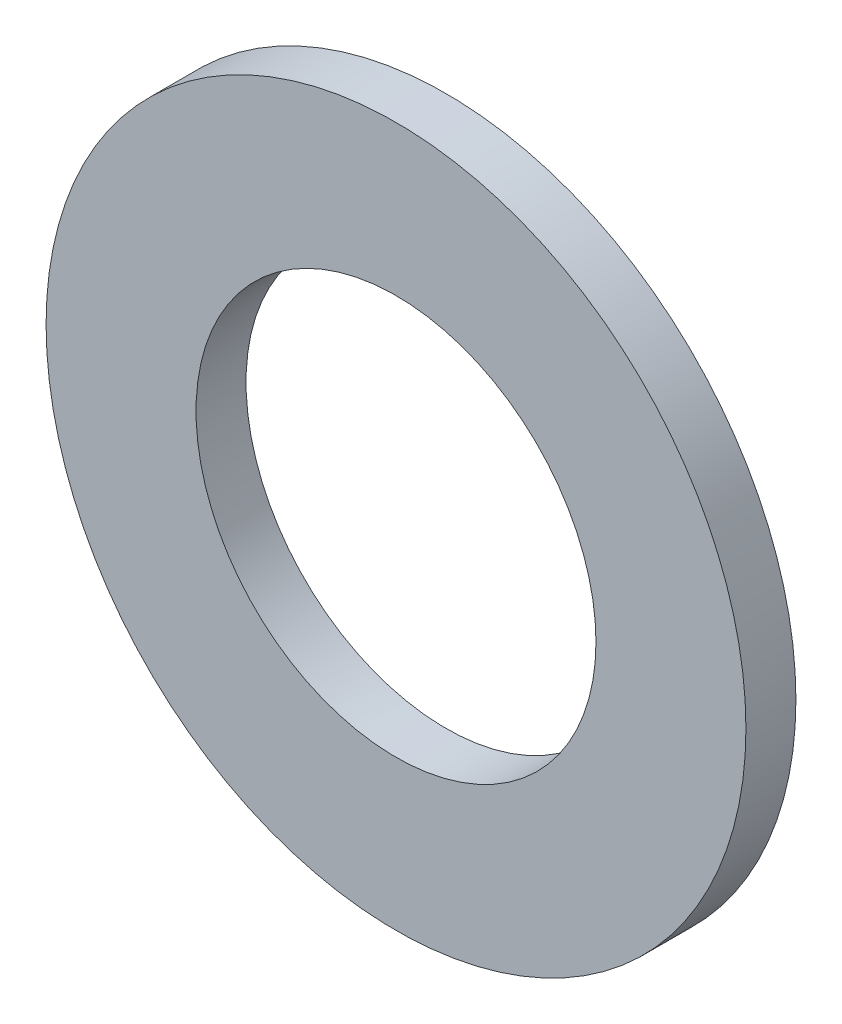
ISO-10303-21;
HEADER;
FILE_DESCRIPTION(('STEP AP214'),'2;1');
FILE_NAME('part.step','',(''),(''),'','','');
FILE_SCHEMA(('AUTOMOTIVE_DESIGN { 1 0 10303 214 1 1 1 1 }'));
ENDSEC;
DATA;
#1=APPLICATION_CONTEXT('core data for automotive mechanical design processes');
#2=APPLICATION_PROTOCOL_DEFINITION('international standard','automotive_design',2000,#1);
#3=PRODUCT_CONTEXT('',#1,'mechanical');
#4=PRODUCT('Part','Part','',(#3));
#5=PRODUCT_RELATED_PRODUCT_CATEGORY('part','',(#4));
#6=PRODUCT_DEFINITION_FORMATION('','',#4);
#7=PRODUCT_DEFINITION_CONTEXT('part definition',#1,'design');
#8=PRODUCT_DEFINITION('design','',#6,#7);
#9=PRODUCT_DEFINITION_SHAPE('','',#8);
#10=(LENGTH_UNIT() NAMED_UNIT(*) SI_UNIT(.MILLI.,.METRE.));
#11=(NAMED_UNIT(*) PLANE_ANGLE_UNIT() SI_UNIT($,.RADIAN.));
#12=(NAMED_UNIT(*) SI_UNIT($,.STERADIAN.) SOLID_ANGLE_UNIT());
#13=UNCERTAINTY_MEASURE_WITH_UNIT(LENGTH_MEASURE(1.E-05),#10,'distance_accuracy_value','');
#14=(GEOMETRIC_REPRESENTATION_CONTEXT(3) GLOBAL_UNCERTAINTY_ASSIGNED_CONTEXT((#13)) GLOBAL_UNIT_ASSIGNED_CONTEXT((#10,
#11,#12)) REPRESENTATION_CONTEXT('',''));
#15=CARTESIAN_POINT('',(0.,0.,0.));
#16=DIRECTION('',(0.,0.,1.));
#17=DIRECTION('',(1.,0.,0.));
#18=AXIS2_PLACEMENT_3D('',#15,#16,#17);
#19=CARTESIAN_POINT('',(0.,0.,1.));
#20=DIRECTION('',(0.,0.,1.));
#21=DIRECTION('',(1.,0.,0.));
#22=AXIS2_PLACEMENT_3D('',#19,#20,#21);
#23=PLANE('',#22);
#24=CARTESIAN_POINT('',(0.,0.,1.));
#25=DIRECTION('',(0.,0.,1.));
#26=DIRECTION('',(1.,0.,0.));
#27=AXIS2_PLACEMENT_3D('',#24,#25,#26);
#28=CIRCLE('',#27,7.);
#29=CARTESIAN_POINT('',(7.,0.,1.));
#30=VERTEX_POINT('',#29);
#31=EDGE_CURVE('E10',#30,#30,#28,.T.);
#32=ORIENTED_EDGE('',*,*,#31,.T.);
#33=EDGE_LOOP('',(#32));
#34=FACE_BOUND('',#33,.T.);
#35=CARTESIAN_POINT('',(0.,0.,1.));
#36=DIRECTION('',(0.,0.,1.));
#37=DIRECTION('',(1.,0.,0.));
#38=AXIS2_PLACEMENT_3D('',#35,#36,#37);
#39=CIRCLE('',#38,4.);
#40=CARTESIAN_POINT('',(4.,0.,1.));
#41=VERTEX_POINT('',#40);
#42=EDGE_CURVE('E42',#41,#41,#39,.T.);
#43=ORIENTED_EDGE('',*,*,#42,.F.);
#44=EDGE_LOOP('',(#43));
#45=FACE_BOUND('',#44,.T.);
#46=ADVANCED_FACE('F31',(#34,#45),#23,.T.);
#47=CARTESIAN_POINT('',(0.,0.,0.));
#48=DIRECTION('',(0.,0.,1.));
#49=DIRECTION('',(1.,0.,0.));
#50=AXIS2_PLACEMENT_3D('',#47,#48,#49);
#51=PLANE('',#50);
#52=CARTESIAN_POINT('',(0.,0.,0.));
#53=DIRECTION('',(0.,0.,1.));
#54=DIRECTION('',(1.,0.,0.));
#55=AXIS2_PLACEMENT_3D('',#52,#53,#54);
#56=CIRCLE('',#55,7.);
#57=CARTESIAN_POINT('',(7.,0.,0.));
#58=VERTEX_POINT('',#57);
#59=EDGE_CURVE('E35',#58,#58,#56,.T.);
#60=ORIENTED_EDGE('',*,*,#59,.F.);
#61=EDGE_LOOP('',(#60));
#62=FACE_BOUND('',#61,.T.);
#63=CARTESIAN_POINT('',(0.,0.,0.));
#64=DIRECTION('',(0.,0.,1.));
#65=DIRECTION('',(1.,0.,0.));
#66=AXIS2_PLACEMENT_3D('',#63,#64,#65);
#67=CIRCLE('',#66,4.);
#68=CARTESIAN_POINT('',(4.,0.,0.));
#69=VERTEX_POINT('',#68);
#70=EDGE_CURVE('E44',#69,#69,#67,.T.);
#71=ORIENTED_EDGE('',*,*,#70,.T.);
#72=EDGE_LOOP('',(#71));
#73=FACE_BOUND('',#72,.T.);
#74=ADVANCED_FACE('F54',(#62,#73),#51,.F.);
#75=CARTESIAN_POINT('',(0.,0.,1.));
#76=DIRECTION('',(0.,0.,-1.));
#77=DIRECTION('',(-1.,0.,0.));
#78=AXIS2_PLACEMENT_3D('',#75,#76,#77);
#79=CYLINDRICAL_SURFACE('',#78,7.);
#80=ORIENTED_EDGE('',*,*,#31,.F.);
#81=EDGE_LOOP('',(#80));
#82=FACE_BOUND('',#81,.T.);
#83=ORIENTED_EDGE('',*,*,#59,.T.);
#84=EDGE_LOOP('',(#83));
#85=FACE_BOUND('',#84,.T.);
#86=ADVANCED_FACE('F33',(#82,#85),#79,.T.);
#87=CARTESIAN_POINT('',(0.,0.,1.));
#88=DIRECTION('',(0.,0.,-1.));
#89=DIRECTION('',(-1.,0.,0.));
#90=AXIS2_PLACEMENT_3D('',#87,#88,#89);
#91=CYLINDRICAL_SURFACE('',#90,4.);
#92=ORIENTED_EDGE('',*,*,#42,.T.);
#93=EDGE_LOOP('',(#92));
#94=FACE_BOUND('',#93,.T.);
#95=ORIENTED_EDGE('',*,*,#70,.F.);
#96=EDGE_LOOP('',(#95));
#97=FACE_BOUND('',#96,.T.);
#98=ADVANCED_FACE('F50',(#94,#97),#91,.F.);
#99=CLOSED_SHELL('',(#46,#74,#86,#98));
#100=MANIFOLD_SOLID_BREP('B2',#99);
#101=ADVANCED_BREP_SHAPE_REPRESENTATION('',(#18,#100),#14);
#102=SHAPE_DEFINITION_REPRESENTATION(#9,#101);
ENDSEC;
END-ISO-10303-21;
